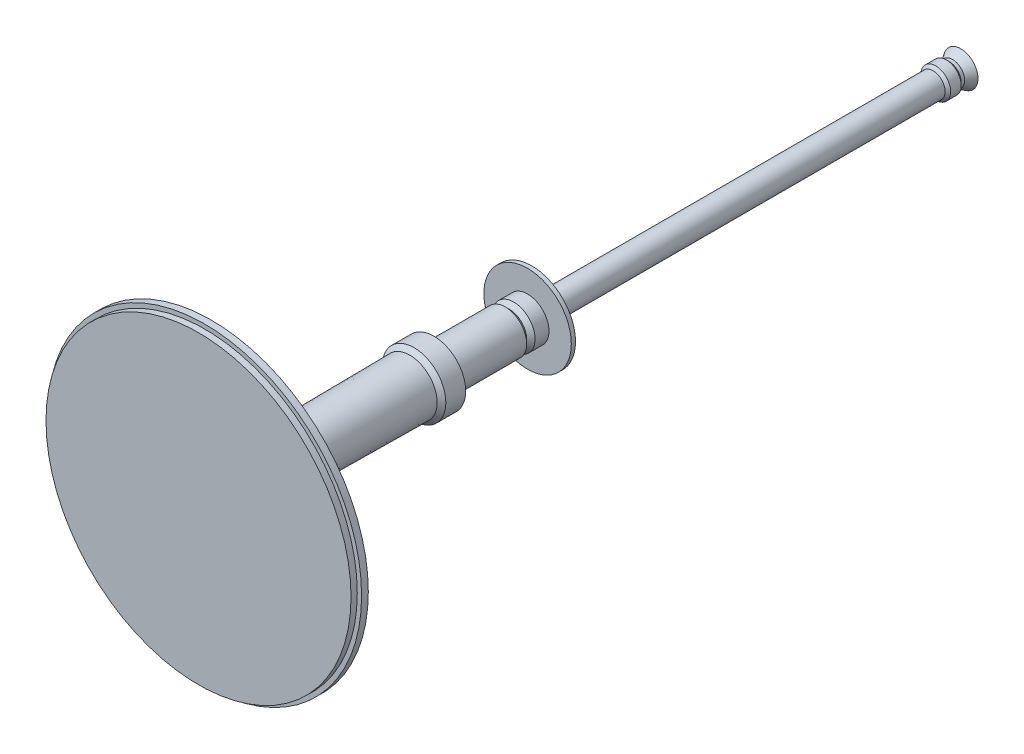
ISO-10303-21;
HEADER;
FILE_DESCRIPTION(('STEP AP214'),'2;1');
FILE_NAME('part.step','',(''),(''),'','','');
FILE_SCHEMA(('AUTOMOTIVE_DESIGN { 1 0 10303 214 1 1 1 1 }'));
ENDSEC;
DATA;
#1=APPLICATION_CONTEXT('core data for automotive mechanical design processes');
#2=APPLICATION_PROTOCOL_DEFINITION('international standard','automotive_design',2000,#1);
#3=PRODUCT_CONTEXT('',#1,'mechanical');
#4=PRODUCT('Part','Part','',(#3));
#5=PRODUCT_RELATED_PRODUCT_CATEGORY('part','',(#4));
#6=PRODUCT_DEFINITION_FORMATION('','',#4);
#7=PRODUCT_DEFINITION_CONTEXT('part definition',#1,'design');
#8=PRODUCT_DEFINITION('design','',#6,#7);
#9=PRODUCT_DEFINITION_SHAPE('','',#8);
#10=(LENGTH_UNIT() NAMED_UNIT(*) SI_UNIT(.MILLI.,.METRE.));
#11=(NAMED_UNIT(*) PLANE_ANGLE_UNIT() SI_UNIT($,.RADIAN.));
#12=(NAMED_UNIT(*) SI_UNIT($,.STERADIAN.) SOLID_ANGLE_UNIT());
#13=UNCERTAINTY_MEASURE_WITH_UNIT(LENGTH_MEASURE(1.E-05),#10,'distance_accuracy_value','');
#14=(GEOMETRIC_REPRESENTATION_CONTEXT(3) GLOBAL_UNCERTAINTY_ASSIGNED_CONTEXT((#13)) GLOBAL_UNIT_ASSIGNED_CONTEXT((#10,
#11,#12)) REPRESENTATION_CONTEXT('',''));
#15=CARTESIAN_POINT('',(0.,0.,0.));
#16=DIRECTION('',(0.,0.,1.));
#17=DIRECTION('',(1.,0.,0.));
#18=AXIS2_PLACEMENT_3D('',#15,#16,#17);
#19=CARTESIAN_POINT('',(0.,0.,-996.97983182204));
#20=DIRECTION('',(0.,0.,-1.));
#21=DIRECTION('',(-1.,0.,0.));
#22=AXIS2_PLACEMENT_3D('',#19,#20,#21);
#23=PLANE('',#22);
#24=CARTESIAN_POINT('',(0.,0.,-996.97983182204));
#25=DIRECTION('',(0.,0.,1.));
#26=DIRECTION('',(1.,0.,0.));
#27=AXIS2_PLACEMENT_3D('',#24,#25,#26);
#28=CIRCLE('',#27,448.154362623253);
#29=CARTESIAN_POINT('',(448.154362623253,0.,-996.97983182204));
#30=VERTEX_POINT('',#29);
#31=EDGE_CURVE('E10',#30,#30,#28,.T.);
#32=ORIENTED_EDGE('',*,*,#31,.T.);
#33=EDGE_LOOP('',(#32));
#34=FACE_BOUND('',#33,.T.);
#35=ADVANCED_FACE('F34',(#34),#23,.F.);
#36=CARTESIAN_POINT('',(0.,0.,0.));
#37=DIRECTION('',(0.,0.,1.));
#38=DIRECTION('',(1.,0.,0.));
#39=AXIS2_PLACEMENT_3D('',#36,#37,#38);
#40=CYLINDRICAL_SURFACE('',#39,448.154362623253);
#41=ORIENTED_EDGE('',*,*,#31,.F.);
#42=EDGE_LOOP('',(#41));
#43=FACE_BOUND('',#42,.T.);
#44=CARTESIAN_POINT('',(0.,0.,-1015.30949835129));
#45=DIRECTION('',(0.,0.,1.));
#46=DIRECTION('',(1.,0.,0.));
#47=AXIS2_PLACEMENT_3D('',#44,#45,#46);
#48=CIRCLE('',#47,448.154362623253);
#49=CARTESIAN_POINT('',(448.154362623253,0.,-1015.30949835129));
#50=VERTEX_POINT('',#49);
#51=EDGE_CURVE('E40',#50,#50,#48,.T.);
#52=ORIENTED_EDGE('',*,*,#51,.T.);
#53=EDGE_LOOP('',(#52));
#54=FACE_BOUND('',#53,.T.);
#55=ADVANCED_FACE('F147',(#43,#54),#40,.T.);
#56=CARTESIAN_POINT('',(0.,448.154362623253,-1015.30949835129));
#57=DIRECTION('',(0.,0.,-1.));
#58=DIRECTION('',(-1.,0.,0.));
#59=AXIS2_PLACEMENT_3D('',#56,#57,#58);
#60=PLANE('',#59);
#61=ORIENTED_EDGE('',*,*,#51,.F.);
#62=EDGE_LOOP('',(#61));
#63=FACE_BOUND('',#62,.T.);
#64=CARTESIAN_POINT('',(0.,0.,-1015.30949835129));
#65=DIRECTION('',(0.,0.,1.));
#66=DIRECTION('',(1.,0.,0.));
#67=AXIS2_PLACEMENT_3D('',#64,#65,#66);
#68=CIRCLE('',#67,460.844131758887);
#69=CARTESIAN_POINT('',(460.844131758887,0.,-1015.30949835129));
#70=VERTEX_POINT('',#69);
#71=EDGE_CURVE('E44',#70,#70,#68,.T.);
#72=ORIENTED_EDGE('',*,*,#71,.T.);
#73=EDGE_LOOP('',(#72));
#74=FACE_BOUND('',#73,.T.);
#75=ADVANCED_FACE('F151',(#63,#74),#60,.F.);
#76=CARTESIAN_POINT('',(0.,0.,0.));
#77=DIRECTION('',(0.,0.,1.));
#78=DIRECTION('',(1.,0.,0.));
#79=AXIS2_PLACEMENT_3D('',#76,#77,#78);
#80=CYLINDRICAL_SURFACE('',#79,460.844131758887);
#81=ORIENTED_EDGE('',*,*,#71,.F.);
#82=EDGE_LOOP('',(#81));
#83=FACE_BOUND('',#82,.T.);
#84=CARTESIAN_POINT('',(0.,0.,-1035.04913922894));
#85=DIRECTION('',(0.,0.,1.));
#86=DIRECTION('',(1.,0.,0.));
#87=AXIS2_PLACEMENT_3D('',#84,#85,#86);
#88=CIRCLE('',#87,460.844131758887);
#89=CARTESIAN_POINT('',(460.844131758887,0.,-1035.04913922894));
#90=VERTEX_POINT('',#89);
#91=EDGE_CURVE('E48',#90,#90,#88,.T.);
#92=ORIENTED_EDGE('',*,*,#91,.T.);
#93=EDGE_LOOP('',(#92));
#94=FACE_BOUND('',#93,.T.);
#95=ADVANCED_FACE('F156',(#83,#94),#80,.T.);
#96=CARTESIAN_POINT('',(0.,448.154362623253,-1035.04913922894));
#97=DIRECTION('',(0.,0.,1.));
#98=DIRECTION('',(1.,0.,0.));
#99=AXIS2_PLACEMENT_3D('',#96,#97,#98);
#100=PLANE('',#99);
#101=ORIENTED_EDGE('',*,*,#91,.F.);
#102=EDGE_LOOP('',(#101));
#103=FACE_BOUND('',#102,.T.);
#104=CARTESIAN_POINT('',(0.,0.,-1035.04913922894));
#105=DIRECTION('',(0.,0.,1.));
#106=DIRECTION('',(1.,0.,0.));
#107=AXIS2_PLACEMENT_3D('',#104,#105,#106);
#108=CIRCLE('',#107,438.418962308779);
#109=CARTESIAN_POINT('',(438.418962308779,0.,-1035.04913922894));
#110=VERTEX_POINT('',#109);
#111=EDGE_CURVE('E53',#110,#110,#108,.T.);
#112=ORIENTED_EDGE('',*,*,#111,.T.);
#113=EDGE_LOOP('',(#112));
#114=FACE_BOUND('',#113,.T.);
#115=ADVANCED_FACE('F162',(#103,#114),#100,.F.);
#116=CARTESIAN_POINT('',(0.,0.,0.));
#117=DIRECTION('',(0.,0.,1.));
#118=DIRECTION('',(1.,0.,0.));
#119=AXIS2_PLACEMENT_3D('',#116,#117,#118);
#120=CYLINDRICAL_SURFACE('',#119,438.418962308779);
#121=ORIENTED_EDGE('',*,*,#111,.F.);
#122=EDGE_LOOP('',(#121));
#123=FACE_BOUND('',#122,.T.);
#124=CARTESIAN_POINT('',(0.,0.,-1049.7393828043));
#125=DIRECTION('',(0.,0.,1.));
#126=DIRECTION('',(1.,0.,0.));
#127=AXIS2_PLACEMENT_3D('',#124,#125,#126);
#128=CIRCLE('',#127,438.418962308779);
#129=CARTESIAN_POINT('',(438.418962308779,0.,-1049.7393828043));
#130=VERTEX_POINT('',#129);
#131=EDGE_CURVE('E56',#130,#130,#128,.T.);
#132=ORIENTED_EDGE('',*,*,#131,.T.);
#133=EDGE_LOOP('',(#132));
#134=FACE_BOUND('',#133,.T.);
#135=ADVANCED_FACE('F166',(#123,#134),#120,.T.);
#136=CARTESIAN_POINT('',(0.,438.418962308779,-1049.7393828043));
#137=DIRECTION('',(0.,0.,1.));
#138=DIRECTION('',(1.,0.,0.));
#139=AXIS2_PLACEMENT_3D('',#136,#137,#138);
#140=PLANE('',#139);
#141=ORIENTED_EDGE('',*,*,#131,.F.);
#142=EDGE_LOOP('',(#141));
#143=FACE_BOUND('',#142,.T.);
#144=CARTESIAN_POINT('',(0.,0.,-1049.7393828043));
#145=DIRECTION('',(0.,0.,1.));
#146=DIRECTION('',(1.,0.,0.));
#147=AXIS2_PLACEMENT_3D('',#144,#145,#146);
#148=CIRCLE('',#147,107.862695978911);
#149=CARTESIAN_POINT('',(107.862695978911,0.,-1049.7393828043));
#150=VERTEX_POINT('',#149);
#151=EDGE_CURVE('E59',#150,#150,#148,.T.);
#152=ORIENTED_EDGE('',*,*,#151,.T.);
#153=EDGE_LOOP('',(#152));
#154=FACE_BOUND('',#153,.T.);
#155=ADVANCED_FACE('F170',(#143,#154),#140,.F.);
#156=CARTESIAN_POINT('',(0.,0.,0.));
#157=DIRECTION('',(0.,0.,1.));
#158=DIRECTION('',(1.,0.,0.));
#159=AXIS2_PLACEMENT_3D('',#156,#157,#158);
#160=CYLINDRICAL_SURFACE('',#159,107.862695978911);
#161=ORIENTED_EDGE('',*,*,#151,.F.);
#162=EDGE_LOOP('',(#161));
#163=FACE_BOUND('',#162,.T.);
#164=CARTESIAN_POINT('',(0.,0.,-1082.4718279001));
#165=DIRECTION('',(0.,0.,1.));
#166=DIRECTION('',(1.,0.,0.));
#167=AXIS2_PLACEMENT_3D('',#164,#165,#166);
#168=CIRCLE('',#167,107.862695978911);
#169=CARTESIAN_POINT('',(107.862695978911,0.,-1082.4718279001));
#170=VERTEX_POINT('',#169);
#171=EDGE_CURVE('E62',#170,#170,#168,.T.);
#172=ORIENTED_EDGE('',*,*,#171,.T.);
#173=EDGE_LOOP('',(#172));
#174=FACE_BOUND('',#173,.T.);
#175=ADVANCED_FACE('F174',(#163,#174),#160,.T.);
#176=CARTESIAN_POINT('',(0.,107.862695978911,-1082.4718279001));
#177=DIRECTION('',(0.,0.,1.));
#178=DIRECTION('',(1.,0.,0.));
#179=AXIS2_PLACEMENT_3D('',#176,#177,#178);
#180=PLANE('',#179);
#181=ORIENTED_EDGE('',*,*,#171,.F.);
#182=EDGE_LOOP('',(#181));
#183=FACE_BOUND('',#182,.T.);
#184=CARTESIAN_POINT('',(0.,0.,-1082.4718279001));
#185=DIRECTION('',(0.,0.,1.));
#186=DIRECTION('',(1.,0.,0.));
#187=AXIS2_PLACEMENT_3D('',#184,#185,#186);
#188=CIRCLE('',#187,93.316370140374);
#189=CARTESIAN_POINT('',(93.316370140374,0.,-1082.4718279001));
#190=VERTEX_POINT('',#189);
#191=EDGE_CURVE('E65',#190,#190,#188,.T.);
#192=ORIENTED_EDGE('',*,*,#191,.T.);
#193=EDGE_LOOP('',(#192));
#194=FACE_BOUND('',#193,.T.);
#195=ADVANCED_FACE('F178',(#183,#194),#180,.F.);
#196=CARTESIAN_POINT('',(0.,0.,-1090.93307685915));
#197=DIRECTION('',(0.,0.,1.));
#198=DIRECTION('',(1.,0.,0.));
#199=AXIS2_PLACEMENT_3D('',#196,#197,#198);
#200=CONICAL_SURFACE('',#199,84.8551211813189,0.785398163397439);
#201=ORIENTED_EDGE('',*,*,#191,.F.);
#202=EDGE_LOOP('',(#201));
#203=FACE_BOUND('',#202,.T.);
#204=CARTESIAN_POINT('',(0.,0.,-1090.93307685915));
#205=DIRECTION('',(0.,0.,1.));
#206=DIRECTION('',(1.,0.,0.));
#207=AXIS2_PLACEMENT_3D('',#204,#205,#206);
#208=CIRCLE('',#207,84.8551211813189);
#209=CARTESIAN_POINT('',(84.8551211813189,0.,-1090.93307685915));
#210=VERTEX_POINT('',#209);
#211=EDGE_CURVE('E68',#210,#210,#208,.T.);
#212=ORIENTED_EDGE('',*,*,#211,.T.);
#213=EDGE_LOOP('',(#212));
#214=FACE_BOUND('',#213,.T.);
#215=ADVANCED_FACE('F182',(#203,#214),#200,.T.);
#216=CARTESIAN_POINT('',(0.,0.,0.));
#217=DIRECTION('',(0.,0.,1.));
#218=DIRECTION('',(1.,0.,0.));
#219=AXIS2_PLACEMENT_3D('',#216,#217,#218);
#220=CYLINDRICAL_SURFACE('',#219,84.8551211813189);
#221=ORIENTED_EDGE('',*,*,#211,.F.);
#222=EDGE_LOOP('',(#221));
#223=FACE_BOUND('',#222,.T.);
#224=CARTESIAN_POINT('',(0.,0.,-1156.28014307152));
#225=DIRECTION('',(0.,0.,1.));
#226=DIRECTION('',(1.,0.,0.));
#227=AXIS2_PLACEMENT_3D('',#224,#225,#226);
#228=CIRCLE('',#227,84.8551211813189);
#229=CARTESIAN_POINT('',(84.8551211813189,0.,-1156.28014307152));
#230=VERTEX_POINT('',#229);
#231=EDGE_CURVE('E71',#230,#230,#228,.T.);
#232=ORIENTED_EDGE('',*,*,#231,.T.);
#233=EDGE_LOOP('',(#232));
#234=FACE_BOUND('',#233,.T.);
#235=ADVANCED_FACE('F186',(#223,#234),#220,.T.);
#236=CARTESIAN_POINT('',(0.,84.8551211813189,-1156.28014307152));
#237=DIRECTION('',(0.,0.,1.));
#238=DIRECTION('',(1.,0.,0.));
#239=AXIS2_PLACEMENT_3D('',#236,#237,#238);
#240=PLANE('',#239);
#241=ORIENTED_EDGE('',*,*,#231,.F.);
#242=EDGE_LOOP('',(#241));
#243=FACE_BOUND('',#242,.T.);
#244=CARTESIAN_POINT('',(0.,0.,-1156.28014307152));
#245=DIRECTION('',(0.,0.,1.));
#246=DIRECTION('',(1.,0.,0.));
#247=AXIS2_PLACEMENT_3D('',#244,#245,#246);
#248=CIRCLE('',#247,76.4114534406292);
#249=CARTESIAN_POINT('',(76.4114534406292,0.,-1156.28014307152));
#250=VERTEX_POINT('',#249);
#251=EDGE_CURVE('E74',#250,#250,#248,.T.);
#252=ORIENTED_EDGE('',*,*,#251,.T.);
#253=EDGE_LOOP('',(#252));
#254=FACE_BOUND('',#253,.T.);
#255=ADVANCED_FACE('F190',(#243,#254),#240,.F.);
#256=CARTESIAN_POINT('',(0.,0.,-1617.58929335606));
#257=DIRECTION('',(0.,0.,-1.));
#258=DIRECTION('',(-1.,0.,0.));
#259=AXIS2_PLACEMENT_3D('',#256,#257,#258);
#260=CONICAL_SURFACE('',#259,80.6332873109741,0.00915159823968516);
#261=ORIENTED_EDGE('',*,*,#251,.F.);
#262=EDGE_LOOP('',(#261));
#263=FACE_BOUND('',#262,.T.);
#264=CARTESIAN_POINT('',(0.,0.,-1617.58929335606));
#265=DIRECTION('',(0.,0.,1.));
#266=DIRECTION('',(1.,0.,0.));
#267=AXIS2_PLACEMENT_3D('',#264,#265,#266);
#268=CIRCLE('',#267,80.6332873109741);
#269=CARTESIAN_POINT('',(80.6332873109741,0.,-1617.58929335606));
#270=VERTEX_POINT('',#269);
#271=EDGE_CURVE('E77',#270,#270,#268,.T.);
#272=ORIENTED_EDGE('',*,*,#271,.T.);
#273=EDGE_LOOP('',(#272));
#274=FACE_BOUND('',#273,.T.);
#275=ADVANCED_FACE('F194',(#263,#274),#260,.T.);
#276=CARTESIAN_POINT('',(0.,0.,-1630.27237618546));
#277=DIRECTION('',(0.,0.,-1.));
#278=DIRECTION('',(-1.,0.,0.));
#279=AXIS2_PLACEMENT_3D('',#276,#277,#278);
#280=CONICAL_SURFACE('',#279,93.316370140374,0.785398163397462);
#281=ORIENTED_EDGE('',*,*,#271,.F.);
#282=EDGE_LOOP('',(#281));
#283=FACE_BOUND('',#282,.T.);
#284=CARTESIAN_POINT('',(0.,0.,-1630.27237618546));
#285=DIRECTION('',(0.,0.,1.));
#286=DIRECTION('',(1.,0.,0.));
#287=AXIS2_PLACEMENT_3D('',#284,#285,#286);
#288=CIRCLE('',#287,93.316370140374);
#289=CARTESIAN_POINT('',(93.316370140374,0.,-1630.27237618546));
#290=VERTEX_POINT('',#289);
#291=EDGE_CURVE('E80',#290,#290,#288,.T.);
#292=ORIENTED_EDGE('',*,*,#291,.T.);
#293=EDGE_LOOP('',(#292));
#294=FACE_BOUND('',#293,.T.);
#295=ADVANCED_FACE('F198',(#283,#294),#280,.T.);
#296=CARTESIAN_POINT('',(0.,0.,0.));
#297=DIRECTION('',(0.,0.,1.));
#298=DIRECTION('',(1.,0.,0.));
#299=AXIS2_PLACEMENT_3D('',#296,#297,#298);
#300=CYLINDRICAL_SURFACE('',#299,93.316370140374);
#301=ORIENTED_EDGE('',*,*,#291,.F.);
#302=EDGE_LOOP('',(#301));
#303=FACE_BOUND('',#302,.T.);
#304=CARTESIAN_POINT('',(0.,0.,-1688.66525709702));
#305=DIRECTION('',(0.,0.,1.));
#306=DIRECTION('',(1.,0.,0.));
#307=AXIS2_PLACEMENT_3D('',#304,#305,#306);
#308=CIRCLE('',#307,93.316370140374);
#309=CARTESIAN_POINT('',(93.316370140374,0.,-1688.66525709702));
#310=VERTEX_POINT('',#309);
#311=EDGE_CURVE('E83',#310,#310,#308,.T.);
#312=ORIENTED_EDGE('',*,*,#311,.T.);
#313=EDGE_LOOP('',(#312));
#314=FACE_BOUND('',#313,.T.);
#315=ADVANCED_FACE('F202',(#303,#314),#300,.T.);
#316=CARTESIAN_POINT('',(0.,93.316370140374,-1688.66525709702));
#317=DIRECTION('',(0.,0.,1.));
#318=DIRECTION('',(1.,0.,0.));
#319=AXIS2_PLACEMENT_3D('',#316,#317,#318);
#320=PLANE('',#319);
#321=ORIENTED_EDGE('',*,*,#311,.F.);
#322=EDGE_LOOP('',(#321));
#323=FACE_BOUND('',#322,.T.);
#324=CARTESIAN_POINT('',(0.,0.,-1688.66525709702));
#325=DIRECTION('',(0.,0.,1.));
#326=DIRECTION('',(1.,0.,0.));
#327=AXIS2_PLACEMENT_3D('',#324,#325,#326);
#328=CIRCLE('',#327,62.9541070130157);
#329=CARTESIAN_POINT('',(62.9541070130157,0.,-1688.66525709702));
#330=VERTEX_POINT('',#329);
#331=EDGE_CURVE('E86',#330,#330,#328,.T.);
#332=ORIENTED_EDGE('',*,*,#331,.T.);
#333=EDGE_LOOP('',(#332));
#334=FACE_BOUND('',#333,.T.);
#335=ADVANCED_FACE('F206',(#323,#334),#320,.F.);
#336=CARTESIAN_POINT('',(0.,0.,0.));
#337=DIRECTION('',(0.,0.,1.));
#338=DIRECTION('',(1.,0.,0.));
#339=AXIS2_PLACEMENT_3D('',#336,#337,#338);
#340=CYLINDRICAL_SURFACE('',#339,62.9541070130157);
#341=ORIENTED_EDGE('',*,*,#331,.F.);
#342=EDGE_LOOP('',(#341));
#343=FACE_BOUND('',#342,.T.);
#344=CARTESIAN_POINT('',(0.,0.,-1898.21631591913));
#345=DIRECTION('',(0.,0.,1.));
#346=DIRECTION('',(1.,0.,0.));
#347=AXIS2_PLACEMENT_3D('',#344,#345,#346);
#348=CIRCLE('',#347,62.9541070130157);
#349=CARTESIAN_POINT('',(62.9541070130157,0.,-1898.21631591913));
#350=VERTEX_POINT('',#349);
#351=EDGE_CURVE('E89',#350,#350,#348,.T.);
#352=ORIENTED_EDGE('',*,*,#351,.T.);
#353=EDGE_LOOP('',(#352));
#354=FACE_BOUND('',#353,.T.);
#355=ADVANCED_FACE('F210',(#343,#354),#340,.T.);
#356=CARTESIAN_POINT('',(0.,0.,-1910.57547198085));
#357=DIRECTION('',(0.,0.,1.));
#358=DIRECTION('',(1.,0.,0.));
#359=AXIS2_PLACEMENT_3D('',#356,#357,#358);
#360=CONICAL_SURFACE('',#359,50.5949509512989,0.785398163397435);
#361=ORIENTED_EDGE('',*,*,#351,.F.);
#362=EDGE_LOOP('',(#361));
#363=FACE_BOUND('',#362,.T.);
#364=CARTESIAN_POINT('',(0.,0.,-1910.57547198085));
#365=DIRECTION('',(0.,0.,1.));
#366=DIRECTION('',(1.,0.,0.));
#367=AXIS2_PLACEMENT_3D('',#364,#365,#366);
#368=CIRCLE('',#367,50.5949509512989);
#369=CARTESIAN_POINT('',(50.5949509512989,0.,-1910.57547198085));
#370=VERTEX_POINT('',#369);
#371=EDGE_CURVE('E92',#370,#370,#368,.T.);
#372=ORIENTED_EDGE('',*,*,#371,.T.);
#373=EDGE_LOOP('',(#372));
#374=FACE_BOUND('',#373,.T.);
#375=ADVANCED_FACE('F214',(#363,#374),#360,.T.);
#376=CARTESIAN_POINT('',(0.,0.,-1922.93462804257));
#377=DIRECTION('',(0.,0.,-1.));
#378=DIRECTION('',(-1.,0.,0.));
#379=AXIS2_PLACEMENT_3D('',#376,#377,#378);
#380=CONICAL_SURFACE('',#379,62.9541070130157,0.785398163397461);
#381=ORIENTED_EDGE('',*,*,#371,.F.);
#382=EDGE_LOOP('',(#381));
#383=FACE_BOUND('',#382,.T.);
#384=CARTESIAN_POINT('',(0.,0.,-1922.93462804257));
#385=DIRECTION('',(0.,0.,1.));
#386=DIRECTION('',(1.,0.,0.));
#387=AXIS2_PLACEMENT_3D('',#384,#385,#386);
#388=CIRCLE('',#387,62.9541070130157);
#389=CARTESIAN_POINT('',(62.9541070130157,0.,-1922.93462804257));
#390=VERTEX_POINT('',#389);
#391=EDGE_CURVE('E95',#390,#390,#388,.T.);
#392=ORIENTED_EDGE('',*,*,#391,.T.);
#393=EDGE_LOOP('',(#392));
#394=FACE_BOUND('',#393,.T.);
#395=ADVANCED_FACE('F218',(#383,#394),#380,.T.);
#396=CARTESIAN_POINT('',(0.,0.,0.));
#397=DIRECTION('',(0.,0.,1.));
#398=DIRECTION('',(1.,0.,0.));
#399=AXIS2_PLACEMENT_3D('',#396,#397,#398);
#400=CYLINDRICAL_SURFACE('',#399,62.9541070130157);
#401=ORIENTED_EDGE('',*,*,#391,.F.);
#402=EDGE_LOOP('',(#401));
#403=FACE_BOUND('',#402,.T.);
#404=CARTESIAN_POINT('',(0.,0.,-1963.79250457063));
#405=DIRECTION('',(0.,0.,1.));
#406=DIRECTION('',(1.,0.,0.));
#407=AXIS2_PLACEMENT_3D('',#404,#405,#406);
#408=CIRCLE('',#407,62.9541070130157);
#409=CARTESIAN_POINT('',(62.9541070130157,0.,-1963.79250457063));
#410=VERTEX_POINT('',#409);
#411=EDGE_CURVE('E98',#410,#410,#408,.T.);
#412=ORIENTED_EDGE('',*,*,#411,.T.);
#413=EDGE_LOOP('',(#412));
#414=FACE_BOUND('',#413,.T.);
#415=ADVANCED_FACE('F222',(#403,#414),#400,.T.);
#416=CARTESIAN_POINT('',(0.,116.171139602794,-1963.79250457063));
#417=DIRECTION('',(0.,0.,-1.));
#418=DIRECTION('',(-1.,0.,0.));
#419=AXIS2_PLACEMENT_3D('',#416,#417,#418);
#420=PLANE('',#419);
#421=ORIENTED_EDGE('',*,*,#411,.F.);
#422=EDGE_LOOP('',(#421));
#423=FACE_BOUND('',#422,.T.);
#424=CARTESIAN_POINT('',(0.,0.,-1963.79250457063));
#425=DIRECTION('',(0.,0.,1.));
#426=DIRECTION('',(1.,0.,0.));
#427=AXIS2_PLACEMENT_3D('',#424,#425,#426);
#428=CIRCLE('',#427,128.530295664511);
#429=CARTESIAN_POINT('',(128.530295664511,0.,-1963.79250457063));
#430=VERTEX_POINT('',#429);
#431=EDGE_CURVE('E101',#430,#430,#428,.T.);
#432=ORIENTED_EDGE('',*,*,#431,.T.);
#433=EDGE_LOOP('',(#432));
#434=FACE_BOUND('',#433,.T.);
#435=ADVANCED_FACE('F226',(#423,#434),#420,.F.);
#436=CARTESIAN_POINT('',(0.,0.,0.));
#437=DIRECTION('',(0.,0.,1.));
#438=DIRECTION('',(1.,0.,0.));
#439=AXIS2_PLACEMENT_3D('',#436,#437,#438);
#440=CYLINDRICAL_SURFACE('',#439,128.530295664511);
#441=ORIENTED_EDGE('',*,*,#431,.F.);
#442=EDGE_LOOP('',(#441));
#443=FACE_BOUND('',#442,.T.);
#444=CARTESIAN_POINT('',(0.,0.,-1976.15166063234));
#445=DIRECTION('',(0.,0.,1.));
#446=DIRECTION('',(1.,0.,0.));
#447=AXIS2_PLACEMENT_3D('',#444,#445,#446);
#448=CIRCLE('',#447,128.530295664511);
#449=CARTESIAN_POINT('',(128.530295664511,0.,-1976.15166063234));
#450=VERTEX_POINT('',#449);
#451=EDGE_CURVE('E104',#450,#450,#448,.T.);
#452=ORIENTED_EDGE('',*,*,#451,.T.);
#453=EDGE_LOOP('',(#452));
#454=FACE_BOUND('',#453,.T.);
#455=ADVANCED_FACE('F230',(#443,#454),#440,.T.);
#456=CARTESIAN_POINT('',(0.,128.530295664511,-1976.15166063234));
#457=DIRECTION('',(0.,0.,1.));
#458=DIRECTION('',(1.,0.,0.));
#459=AXIS2_PLACEMENT_3D('',#456,#457,#458);
#460=PLANE('',#459);
#461=ORIENTED_EDGE('',*,*,#451,.F.);
#462=EDGE_LOOP('',(#461));
#463=FACE_BOUND('',#462,.T.);
#464=CARTESIAN_POINT('',(0.,0.,-1976.15166063234));
#465=DIRECTION('',(0.,0.,1.));
#466=DIRECTION('',(1.,0.,0.));
#467=AXIS2_PLACEMENT_3D('',#464,#465,#466);
#468=CIRCLE('',#467,93.316370140374);
#469=CARTESIAN_POINT('',(93.316370140374,0.,-1976.15166063234));
#470=VERTEX_POINT('',#469);
#471=EDGE_CURVE('E107',#470,#470,#468,.T.);
#472=ORIENTED_EDGE('',*,*,#471,.T.);
#473=EDGE_LOOP('',(#472));
#474=FACE_BOUND('',#473,.T.);
#475=ADVANCED_FACE('F234',(#463,#474),#460,.F.);
#476=CARTESIAN_POINT('',(0.,0.,-1983.42482355161));
#477=DIRECTION('',(0.,0.,-1.));
#478=DIRECTION('',(-1.,0.,0.));
#479=AXIS2_PLACEMENT_3D('',#476,#477,#478);
#480=CONICAL_SURFACE('',#479,100.589533059643,0.785398163397464);
#481=ORIENTED_EDGE('',*,*,#471,.F.);
#482=EDGE_LOOP('',(#481));
#483=FACE_BOUND('',#482,.T.);
#484=CARTESIAN_POINT('',(0.,0.,-1983.42482355161));
#485=DIRECTION('',(0.,0.,1.));
#486=DIRECTION('',(1.,0.,0.));
#487=AXIS2_PLACEMENT_3D('',#484,#485,#486);
#488=CIRCLE('',#487,100.589533059643);
#489=CARTESIAN_POINT('',(100.589533059643,0.,-1983.42482355161));
#490=VERTEX_POINT('',#489);
#491=EDGE_CURVE('E110',#490,#490,#488,.T.);
#492=ORIENTED_EDGE('',*,*,#491,.T.);
#493=EDGE_LOOP('',(#492));
#494=FACE_BOUND('',#493,.T.);
#495=ADVANCED_FACE('F238',(#483,#494),#480,.T.);
#496=CARTESIAN_POINT('',(0.,100.589533059643,-1983.42482355161));
#497=DIRECTION('',(0.,0.,1.));
#498=DIRECTION('',(1.,0.,0.));
#499=AXIS2_PLACEMENT_3D('',#496,#497,#498);
#500=PLANE('',#499);
#501=ORIENTED_EDGE('',*,*,#491,.F.);
#502=EDGE_LOOP('',(#501));
#503=FACE_BOUND('',#502,.T.);
#504=CARTESIAN_POINT('',(0.,0.,-1983.42482355161));
#505=DIRECTION('',(0.,0.,1.));
#506=DIRECTION('',(1.,0.,0.));
#507=AXIS2_PLACEMENT_3D('',#504,#505,#506);
#508=CIRCLE('',#507,35.664179648347);
#509=CARTESIAN_POINT('',(35.664179648347,0.,-1983.42482355161));
#510=VERTEX_POINT('',#509);
#511=EDGE_CURVE('E113',#510,#510,#508,.T.);
#512=ORIENTED_EDGE('',*,*,#511,.T.);
#513=EDGE_LOOP('',(#512));
#514=FACE_BOUND('',#513,.T.);
#515=ADVANCED_FACE('F242',(#503,#514),#500,.F.);
#516=CARTESIAN_POINT('',(0.,0.,0.));
#517=DIRECTION('',(0.,0.,1.));
#518=DIRECTION('',(1.,0.,0.));
#519=AXIS2_PLACEMENT_3D('',#516,#517,#518);
#520=CYLINDRICAL_SURFACE('',#519,35.664179648347);
#521=ORIENTED_EDGE('',*,*,#511,.F.);
#522=EDGE_LOOP('',(#521));
#523=FACE_BOUND('',#522,.T.);
#524=CARTESIAN_POINT('',(0.,0.,-3155.09721251298));
#525=DIRECTION('',(0.,0.,1.));
#526=DIRECTION('',(1.,0.,0.));
#527=AXIS2_PLACEMENT_3D('',#524,#525,#526);
#528=CIRCLE('',#527,35.664179648347);
#529=CARTESIAN_POINT('',(35.664179648347,0.,-3155.09721251298));
#530=VERTEX_POINT('',#529);
#531=EDGE_CURVE('E116',#530,#530,#528,.T.);
#532=ORIENTED_EDGE('',*,*,#531,.T.);
#533=EDGE_LOOP('',(#532));
#534=FACE_BOUND('',#533,.T.);
#535=ADVANCED_FACE('F246',(#523,#534),#520,.T.);
#536=CARTESIAN_POINT('',(0.,0.,-3163.14602672946));
#537=DIRECTION('',(0.,0.,-1.));
#538=DIRECTION('',(-1.,0.,0.));
#539=AXIS2_PLACEMENT_3D('',#536,#537,#538);
#540=CONICAL_SURFACE('',#539,43.7129938648223,0.785398163397457);
#541=ORIENTED_EDGE('',*,*,#531,.F.);
#542=EDGE_LOOP('',(#541));
#543=FACE_BOUND('',#542,.T.);
#544=CARTESIAN_POINT('',(0.,0.,-3163.14602672946));
#545=DIRECTION('',(0.,0.,1.));
#546=DIRECTION('',(1.,0.,0.));
#547=AXIS2_PLACEMENT_3D('',#544,#545,#546);
#548=CIRCLE('',#547,43.7129938648223);
#549=CARTESIAN_POINT('',(43.7129938648223,0.,-3163.14602672946));
#550=VERTEX_POINT('',#549);
#551=EDGE_CURVE('E119',#550,#550,#548,.T.);
#552=ORIENTED_EDGE('',*,*,#551,.T.);
#553=EDGE_LOOP('',(#552));
#554=FACE_BOUND('',#553,.T.);
#555=ADVANCED_FACE('F250',(#543,#554),#540,.T.);
#556=CARTESIAN_POINT('',(0.,0.,0.));
#557=DIRECTION('',(0.,0.,1.));
#558=DIRECTION('',(1.,0.,0.));
#559=AXIS2_PLACEMENT_3D('',#556,#557,#558);
#560=CYLINDRICAL_SURFACE('',#559,43.7129938648223);
#561=ORIENTED_EDGE('',*,*,#551,.F.);
#562=EDGE_LOOP('',(#561));
#563=FACE_BOUND('',#562,.T.);
#564=CARTESIAN_POINT('',(0.,0.,-3194.16703032189));
#565=DIRECTION('',(0.,0.,1.));
#566=DIRECTION('',(1.,0.,0.));
#567=AXIS2_PLACEMENT_3D('',#564,#565,#566);
#568=CIRCLE('',#567,43.7129938648223);
#569=CARTESIAN_POINT('',(43.7129938648223,0.,-3194.16703032189));
#570=VERTEX_POINT('',#569);
#571=EDGE_CURVE('E122',#570,#570,#568,.T.);
#572=ORIENTED_EDGE('',*,*,#571,.T.);
#573=EDGE_LOOP('',(#572));
#574=FACE_BOUND('',#573,.T.);
#575=ADVANCED_FACE('F254',(#563,#574),#560,.T.);
#576=CARTESIAN_POINT('',(0.,0.,-3202.21584453836));
#577=DIRECTION('',(0.,0.,1.));
#578=DIRECTION('',(1.,0.,0.));
#579=AXIS2_PLACEMENT_3D('',#576,#577,#578);
#580=CONICAL_SURFACE('',#579,35.664179648347,0.785398163397429);
#581=ORIENTED_EDGE('',*,*,#571,.F.);
#582=EDGE_LOOP('',(#581));
#583=FACE_BOUND('',#582,.T.);
#584=CARTESIAN_POINT('',(0.,0.,-3202.21584453836));
#585=DIRECTION('',(0.,0.,1.));
#586=DIRECTION('',(1.,0.,0.));
#587=AXIS2_PLACEMENT_3D('',#584,#585,#586);
#588=CIRCLE('',#587,35.664179648347);
#589=CARTESIAN_POINT('',(35.664179648347,0.,-3202.21584453836));
#590=VERTEX_POINT('',#589);
#591=EDGE_CURVE('E125',#590,#590,#588,.T.);
#592=ORIENTED_EDGE('',*,*,#591,.T.);
#593=EDGE_LOOP('',(#592));
#594=FACE_BOUND('',#593,.T.);
#595=ADVANCED_FACE('F258',(#583,#594),#580,.T.);
#596=CARTESIAN_POINT('',(0.,0.,0.));
#597=DIRECTION('',(0.,0.,1.));
#598=DIRECTION('',(1.,0.,0.));
#599=AXIS2_PLACEMENT_3D('',#596,#597,#598);
#600=CYLINDRICAL_SURFACE('',#599,35.664179648347);
#601=ORIENTED_EDGE('',*,*,#591,.F.);
#602=EDGE_LOOP('',(#601));
#603=FACE_BOUND('',#602,.T.);
#604=CARTESIAN_POINT('',(0.,0.,-3212.39961196604));
#605=DIRECTION('',(0.,0.,1.));
#606=DIRECTION('',(1.,0.,0.));
#607=AXIS2_PLACEMENT_3D('',#604,#605,#606);
#608=CIRCLE('',#607,35.664179648347);
#609=CARTESIAN_POINT('',(35.664179648347,0.,-3212.39961196604));
#610=VERTEX_POINT('',#609);
#611=EDGE_CURVE('E128',#610,#610,#608,.T.);
#612=ORIENTED_EDGE('',*,*,#611,.T.);
#613=EDGE_LOOP('',(#612));
#614=FACE_BOUND('',#613,.T.);
#615=ADVANCED_FACE('F143',(#603,#614),#600,.T.);
#616=CARTESIAN_POINT('',(0.,0.,-3236.70972082491));
#617=DIRECTION('',(0.,0.,-1.));
#618=DIRECTION('',(-1.,0.,0.));
#619=AXIS2_PLACEMENT_3D('',#616,#617,#618);
#620=CONICAL_SURFACE('',#619,50.5949509512989,0.550780439617227);
#621=ORIENTED_EDGE('',*,*,#611,.F.);
#622=EDGE_LOOP('',(#621));
#623=FACE_BOUND('',#622,.T.);
#624=CARTESIAN_POINT('',(0.,0.,-3236.70972082491));
#625=DIRECTION('',(0.,0.,1.));
#626=DIRECTION('',(1.,0.,0.));
#627=AXIS2_PLACEMENT_3D('',#624,#625,#626);
#628=CIRCLE('',#627,50.5949509512989);
#629=CARTESIAN_POINT('',(50.5949509512989,0.,-3236.70972082491));
#630=VERTEX_POINT('',#629);
#631=EDGE_CURVE('E131',#630,#630,#628,.T.);
#632=ORIENTED_EDGE('',*,*,#631,.T.);
#633=EDGE_LOOP('',(#632));
#634=FACE_BOUND('',#633,.T.);
#635=ADVANCED_FACE('F135',(#623,#634),#620,.T.);
#636=CARTESIAN_POINT('',(0.,50.5949509512989,-3236.70972082491));
#637=DIRECTION('',(0.,0.,1.));
#638=DIRECTION('',(1.,0.,0.));
#639=AXIS2_PLACEMENT_3D('',#636,#637,#638);
#640=PLANE('',#639);
#641=ORIENTED_EDGE('',*,*,#631,.F.);
#642=EDGE_LOOP('',(#641));
#643=FACE_BOUND('',#642,.T.);
#644=ADVANCED_FACE('F137',(#643),#640,.F.);
#645=CLOSED_SHELL('',(#35,#55,#75,#95,#115,#135,#155,#175,#195,#215,#235,#255,#275,#295,#315,
#335,#355,#375,#395,#415,#435,#455,#475,#495,#515,#535,#555,#575,#595,#615,#635,#644));
#646=MANIFOLD_SOLID_BREP('B2',#645);
#647=ADVANCED_BREP_SHAPE_REPRESENTATION('',(#18,#646),#14);
#648=SHAPE_DEFINITION_REPRESENTATION(#9,#647);
ENDSEC;
END-ISO-10303-21;
